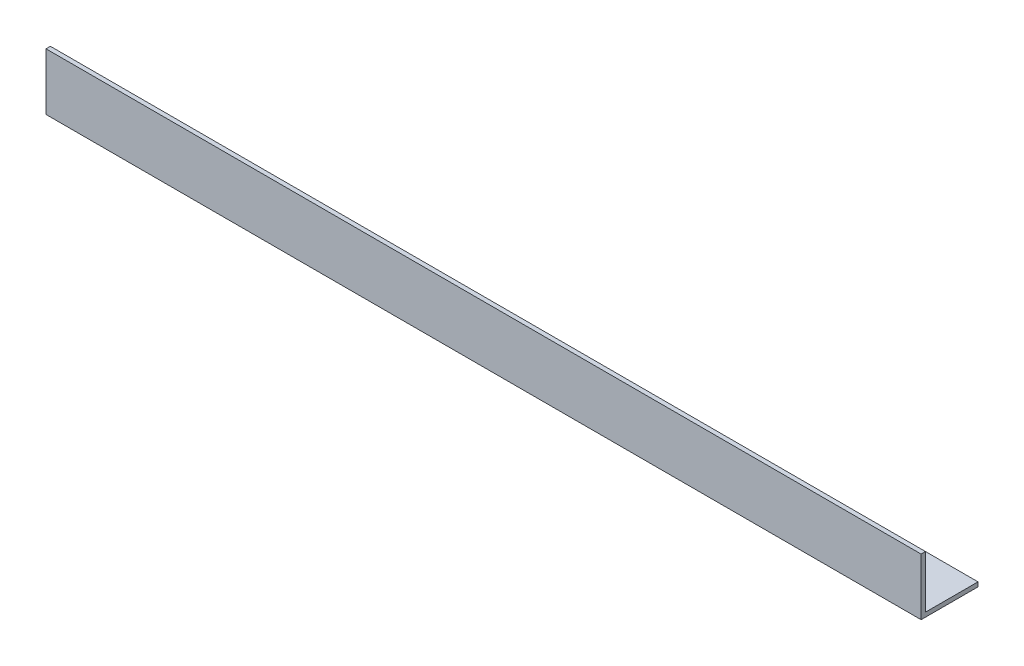
ISO-10303-21;
HEADER;
FILE_DESCRIPTION(('STEP AP214'),'2;1');
FILE_NAME('part.step','',(''),(''),'','','');
FILE_SCHEMA(('AUTOMOTIVE_DESIGN { 1 0 10303 214 1 1 1 1 }'));
ENDSEC;
DATA;
#1=APPLICATION_CONTEXT('core data for automotive mechanical design processes');
#2=APPLICATION_PROTOCOL_DEFINITION('international standard','automotive_design',2000,#1);
#3=PRODUCT_CONTEXT('',#1,'mechanical');
#4=PRODUCT('Part','Part','',(#3));
#5=PRODUCT_RELATED_PRODUCT_CATEGORY('part','',(#4));
#6=PRODUCT_DEFINITION_FORMATION('','',#4);
#7=PRODUCT_DEFINITION_CONTEXT('part definition',#1,'design');
#8=PRODUCT_DEFINITION('design','',#6,#7);
#9=PRODUCT_DEFINITION_SHAPE('','',#8);
#10=(LENGTH_UNIT() NAMED_UNIT(*) SI_UNIT(.MILLI.,.METRE.));
#11=(NAMED_UNIT(*) PLANE_ANGLE_UNIT() SI_UNIT($,.RADIAN.));
#12=(NAMED_UNIT(*) SI_UNIT($,.STERADIAN.) SOLID_ANGLE_UNIT());
#13=UNCERTAINTY_MEASURE_WITH_UNIT(LENGTH_MEASURE(1.E-05),#10,'distance_accuracy_value','');
#14=(GEOMETRIC_REPRESENTATION_CONTEXT(3) GLOBAL_UNCERTAINTY_ASSIGNED_CONTEXT((#13)) GLOBAL_UNIT_ASSIGNED_CONTEXT((#10,
#11,#12)) REPRESENTATION_CONTEXT('',''));
#15=CARTESIAN_POINT('',(0.,0.,0.));
#16=DIRECTION('',(0.,0.,1.));
#17=DIRECTION('',(1.,0.,0.));
#18=AXIS2_PLACEMENT_3D('',#15,#16,#17);
#19=CARTESIAN_POINT('',(1000.,0.,0.));
#20=DIRECTION('',(0.,1.,0.));
#21=DIRECTION('',(0.,0.,1.));
#22=AXIS2_PLACEMENT_3D('',#19,#20,#21);
#23=PLANE('',#22);
#24=DIRECTION('',(0.,0.,-1.));
#25=VECTOR('',#24,1.);
#26=CARTESIAN_POINT('',(0.,0.,0.));
#27=LINE('',#26,#25);
#28=CARTESIAN_POINT('',(0.,0.,0.));
#29=VERTEX_POINT('',#28);
#30=CARTESIAN_POINT('',(0.,0.,-65.));
#31=VERTEX_POINT('',#30);
#32=EDGE_CURVE('E115',#29,#31,#27,.T.);
#33=ORIENTED_EDGE('',*,*,#32,.T.);
#34=DIRECTION('',(-1.,0.,0.));
#35=VECTOR('',#34,1.);
#36=CARTESIAN_POINT('',(1000.,0.,-65.));
#37=LINE('',#36,#35);
#38=CARTESIAN_POINT('',(1000.,0.,-65.));
#39=VERTEX_POINT('',#38);
#40=EDGE_CURVE('E11',#39,#31,#37,.T.);
#41=ORIENTED_EDGE('',*,*,#40,.F.);
#42=DIRECTION('',(0.,0.,-1.));
#43=VECTOR('',#42,1.);
#44=CARTESIAN_POINT('',(1000.,0.,0.));
#45=LINE('',#44,#43);
#46=CARTESIAN_POINT('',(1000.,0.,0.));
#47=VERTEX_POINT('',#46);
#48=EDGE_CURVE('E80',#47,#39,#45,.T.);
#49=ORIENTED_EDGE('',*,*,#48,.F.);
#50=DIRECTION('',(-1.,0.,0.));
#51=VECTOR('',#50,1.);
#52=CARTESIAN_POINT('',(1000.,0.,0.));
#53=LINE('',#52,#51);
#54=EDGE_CURVE('E111',#47,#29,#53,.T.);
#55=ORIENTED_EDGE('',*,*,#54,.T.);
#56=EDGE_LOOP('',(#33,#41,#49,#55));
#57=FACE_BOUND('',#56,.T.);
#58=ADVANCED_FACE('F34',(#57),#23,.F.);
#59=CARTESIAN_POINT('',(1000.,5.,-65.));
#60=DIRECTION('',(0.,0.,-1.));
#61=DIRECTION('',(-1.,0.,0.));
#62=AXIS2_PLACEMENT_3D('',#59,#60,#61);
#63=PLANE('',#62);
#64=DIRECTION('',(0.,-1.,0.));
#65=VECTOR('',#64,1.);
#66=CARTESIAN_POINT('',(0.,5.,-65.));
#67=LINE('',#66,#65);
#68=CARTESIAN_POINT('',(0.,5.,-65.));
#69=VERTEX_POINT('',#68);
#70=EDGE_CURVE('E118',#69,#31,#67,.T.);
#71=ORIENTED_EDGE('',*,*,#70,.F.);
#72=DIRECTION('',(-1.,0.,0.));
#73=VECTOR('',#72,1.);
#74=CARTESIAN_POINT('',(1000.,5.,-65.));
#75=LINE('',#74,#73);
#76=CARTESIAN_POINT('',(1000.,5.,-65.));
#77=VERTEX_POINT('',#76);
#78=EDGE_CURVE('E42',#77,#69,#75,.T.);
#79=ORIENTED_EDGE('',*,*,#78,.F.);
#80=DIRECTION('',(0.,-1.,0.));
#81=VECTOR('',#80,1.);
#82=CARTESIAN_POINT('',(1000.,5.,-65.));
#83=LINE('',#82,#81);
#84=EDGE_CURVE('E204',#77,#39,#83,.T.);
#85=ORIENTED_EDGE('',*,*,#84,.T.);
#86=ORIENTED_EDGE('',*,*,#40,.T.);
#87=EDGE_LOOP('',(#71,#79,#85,#86));
#88=FACE_BOUND('',#87,.T.);
#89=ADVANCED_FACE('F136',(#88),#63,.T.);
#90=CARTESIAN_POINT('',(1000.,5.,0.));
#91=DIRECTION('',(0.,1.,0.));
#92=DIRECTION('',(0.,0.,1.));
#93=AXIS2_PLACEMENT_3D('',#90,#91,#92);
#94=PLANE('',#93);
#95=DIRECTION('',(0.,0.,-1.));
#96=VECTOR('',#95,1.);
#97=CARTESIAN_POINT('',(0.,5.,0.));
#98=LINE('',#97,#96);
#99=CARTESIAN_POINT('',(0.,5.,-5.));
#100=VERTEX_POINT('',#99);
#101=EDGE_CURVE('E121',#100,#69,#98,.T.);
#102=ORIENTED_EDGE('',*,*,#101,.F.);
#103=DIRECTION('',(-1.,0.,0.));
#104=VECTOR('',#103,1.);
#105=CARTESIAN_POINT('',(1000.,5.,-5.));
#106=LINE('',#105,#104);
#107=CARTESIAN_POINT('',(1000.,5.,-5.));
#108=VERTEX_POINT('',#107);
#109=EDGE_CURVE('E101',#108,#100,#106,.T.);
#110=ORIENTED_EDGE('',*,*,#109,.F.);
#111=DIRECTION('',(0.,0.,-1.));
#112=VECTOR('',#111,1.);
#113=CARTESIAN_POINT('',(1000.,5.,0.));
#114=LINE('',#113,#112);
#115=EDGE_CURVE('E107',#108,#77,#114,.T.);
#116=ORIENTED_EDGE('',*,*,#115,.T.);
#117=ORIENTED_EDGE('',*,*,#78,.T.);
#118=EDGE_LOOP('',(#102,#110,#116,#117));
#119=FACE_BOUND('',#118,.T.);
#120=ADVANCED_FACE('F133',(#119),#94,.T.);
#121=CARTESIAN_POINT('',(1000.,0.,-5.));
#122=DIRECTION('',(0.,0.,-1.));
#123=DIRECTION('',(-1.,0.,0.));
#124=AXIS2_PLACEMENT_3D('',#121,#122,#123);
#125=PLANE('',#124);
#126=DIRECTION('',(0.,1.,0.));
#127=VECTOR('',#126,1.);
#128=CARTESIAN_POINT('',(0.,0.,-5.));
#129=LINE('',#128,#127);
#130=CARTESIAN_POINT('',(0.,65.,-5.));
#131=VERTEX_POINT('',#130);
#132=EDGE_CURVE('E96',#131,#100,#129,.F.);
#133=ORIENTED_EDGE('',*,*,#132,.F.);
#134=DIRECTION('',(-1.,0.,0.));
#135=VECTOR('',#134,1.);
#136=CARTESIAN_POINT('',(1000.,65.,-5.));
#137=LINE('',#136,#135);
#138=CARTESIAN_POINT('',(1000.,65.,-5.));
#139=VERTEX_POINT('',#138);
#140=EDGE_CURVE('E91',#139,#131,#137,.T.);
#141=ORIENTED_EDGE('',*,*,#140,.F.);
#142=DIRECTION('',(0.,1.,0.));
#143=VECTOR('',#142,1.);
#144=CARTESIAN_POINT('',(1000.,0.,-5.));
#145=LINE('',#144,#143);
#146=EDGE_CURVE('E94',#139,#108,#145,.F.);
#147=ORIENTED_EDGE('',*,*,#146,.T.);
#148=ORIENTED_EDGE('',*,*,#109,.T.);
#149=EDGE_LOOP('',(#133,#141,#147,#148));
#150=FACE_BOUND('',#149,.T.);
#151=ADVANCED_FACE('F93',(#150),#125,.T.);
#152=CARTESIAN_POINT('',(1000.,65.,0.));
#153=DIRECTION('',(0.,1.,0.));
#154=DIRECTION('',(0.,0.,1.));
#155=AXIS2_PLACEMENT_3D('',#152,#153,#154);
#156=PLANE('',#155);
#157=DIRECTION('',(0.,0.,-1.));
#158=VECTOR('',#157,1.);
#159=CARTESIAN_POINT('',(0.,65.,0.));
#160=LINE('',#159,#158);
#161=CARTESIAN_POINT('',(0.,65.,0.));
#162=VERTEX_POINT('',#161);
#163=EDGE_CURVE('E125',#162,#131,#160,.T.);
#164=ORIENTED_EDGE('',*,*,#163,.F.);
#165=DIRECTION('',(-1.,0.,0.));
#166=VECTOR('',#165,1.);
#167=CARTESIAN_POINT('',(1000.,65.,0.));
#168=LINE('',#167,#166);
#169=CARTESIAN_POINT('',(1000.,65.,0.));
#170=VERTEX_POINT('',#169);
#171=EDGE_CURVE('E71',#170,#162,#168,.T.);
#172=ORIENTED_EDGE('',*,*,#171,.F.);
#173=DIRECTION('',(0.,0.,-1.));
#174=VECTOR('',#173,1.);
#175=CARTESIAN_POINT('',(1000.,65.,0.));
#176=LINE('',#175,#174);
#177=EDGE_CURVE('E105',#170,#139,#176,.T.);
#178=ORIENTED_EDGE('',*,*,#177,.T.);
#179=ORIENTED_EDGE('',*,*,#140,.T.);
#180=EDGE_LOOP('',(#164,#172,#178,#179));
#181=FACE_BOUND('',#180,.T.);
#182=ADVANCED_FACE('F109',(#181),#156,.T.);
#183=CARTESIAN_POINT('',(1000.,0.,0.));
#184=DIRECTION('',(0.,0.,-1.));
#185=DIRECTION('',(-1.,0.,0.));
#186=AXIS2_PLACEMENT_3D('',#183,#184,#185);
#187=PLANE('',#186);
#188=DIRECTION('',(0.,-1.,0.));
#189=VECTOR('',#188,1.);
#190=CARTESIAN_POINT('',(0.,0.,0.));
#191=LINE('',#190,#189);
#192=EDGE_CURVE('E74',#162,#29,#191,.T.);
#193=ORIENTED_EDGE('',*,*,#192,.T.);
#194=ORIENTED_EDGE('',*,*,#54,.F.);
#195=DIRECTION('',(0.,-1.,0.));
#196=VECTOR('',#195,1.);
#197=CARTESIAN_POINT('',(1000.,0.,0.));
#198=LINE('',#197,#196);
#199=EDGE_CURVE('E50',#170,#47,#198,.T.);
#200=ORIENTED_EDGE('',*,*,#199,.F.);
#201=ORIENTED_EDGE('',*,*,#171,.T.);
#202=EDGE_LOOP('',(#193,#194,#200,#201));
#203=FACE_BOUND('',#202,.T.);
#204=ADVANCED_FACE('F141',(#203),#187,.F.);
#205=CARTESIAN_POINT('',(1000.,0.,0.));
#206=DIRECTION('',(-1.,0.,0.));
#207=DIRECTION('',(0.,0.,1.));
#208=AXIS2_PLACEMENT_3D('',#205,#206,#207);
#209=PLANE('',#208);
#210=ORIENTED_EDGE('',*,*,#48,.T.);
#211=ORIENTED_EDGE('',*,*,#84,.F.);
#212=ORIENTED_EDGE('',*,*,#115,.F.);
#213=ORIENTED_EDGE('',*,*,#146,.F.);
#214=ORIENTED_EDGE('',*,*,#177,.F.);
#215=ORIENTED_EDGE('',*,*,#199,.T.);
#216=EDGE_LOOP('',(#210,#211,#212,#213,#214,#215));
#217=FACE_BOUND('',#216,.T.);
#218=ADVANCED_FACE('F104',(#217),#209,.F.);
#219=CARTESIAN_POINT('',(0.,0.,0.));
#220=DIRECTION('',(-1.,0.,0.));
#221=DIRECTION('',(0.,0.,1.));
#222=AXIS2_PLACEMENT_3D('',#219,#220,#221);
#223=PLANE('',#222);
#224=ORIENTED_EDGE('',*,*,#32,.F.);
#225=ORIENTED_EDGE('',*,*,#192,.F.);
#226=ORIENTED_EDGE('',*,*,#163,.T.);
#227=ORIENTED_EDGE('',*,*,#132,.T.);
#228=ORIENTED_EDGE('',*,*,#101,.T.);
#229=ORIENTED_EDGE('',*,*,#70,.T.);
#230=EDGE_LOOP('',(#224,#225,#226,#227,#228,#229));
#231=FACE_BOUND('',#230,.T.);
#232=ADVANCED_FACE('F139',(#231),#223,.T.);
#233=CLOSED_SHELL('',(#58,#89,#120,#151,#182,#204,#218,#232));
#234=MANIFOLD_SOLID_BREP('B2',#233);
#235=ADVANCED_BREP_SHAPE_REPRESENTATION('',(#18,#234),#14);
#236=SHAPE_DEFINITION_REPRESENTATION(#9,#235);
ENDSEC;
END-ISO-10303-21;
